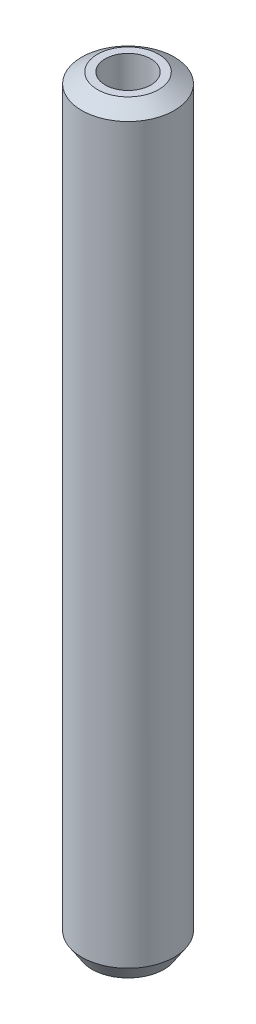
ISO-10303-21;
HEADER;
FILE_DESCRIPTION(('STEP AP214'),'2;1');
FILE_NAME('part.step','',(''),(''),'','','');
FILE_SCHEMA(('AUTOMOTIVE_DESIGN { 1 0 10303 214 1 1 1 1 }'));
ENDSEC;
DATA;
#1=APPLICATION_CONTEXT('core data for automotive mechanical design processes');
#2=APPLICATION_PROTOCOL_DEFINITION('international standard','automotive_design',2000,#1);
#3=PRODUCT_CONTEXT('',#1,'mechanical');
#4=PRODUCT('Part','Part','',(#3));
#5=PRODUCT_RELATED_PRODUCT_CATEGORY('part','',(#4));
#6=PRODUCT_DEFINITION_FORMATION('','',#4);
#7=PRODUCT_DEFINITION_CONTEXT('part definition',#1,'design');
#8=PRODUCT_DEFINITION('design','',#6,#7);
#9=PRODUCT_DEFINITION_SHAPE('','',#8);
#10=(LENGTH_UNIT() NAMED_UNIT(*) SI_UNIT(.MILLI.,.METRE.));
#11=(NAMED_UNIT(*) PLANE_ANGLE_UNIT() SI_UNIT($,.RADIAN.));
#12=(NAMED_UNIT(*) SI_UNIT($,.STERADIAN.) SOLID_ANGLE_UNIT());
#13=UNCERTAINTY_MEASURE_WITH_UNIT(LENGTH_MEASURE(1.E-05),#10,'distance_accuracy_value','');
#14=(GEOMETRIC_REPRESENTATION_CONTEXT(3) GLOBAL_UNCERTAINTY_ASSIGNED_CONTEXT((#13)) GLOBAL_UNIT_ASSIGNED_CONTEXT((#10,
#11,#12)) REPRESENTATION_CONTEXT('',''));
#15=CARTESIAN_POINT('',(0.,0.,0.));
#16=DIRECTION('',(0.,0.,1.));
#17=DIRECTION('',(1.,0.,0.));
#18=AXIS2_PLACEMENT_3D('',#15,#16,#17);
#19=CARTESIAN_POINT('',(0.,327.991136578269,0.));
#20=DIRECTION('',(0.,-1.,0.));
#21=DIRECTION('',(0.,0.,-1.));
#22=AXIS2_PLACEMENT_3D('',#19,#20,#21);
#23=CYLINDRICAL_SURFACE('',#22,20.);
#24=CARTESIAN_POINT('',(0.,323.556740208742,0.));
#25=DIRECTION('',(0.,1.,0.));
#26=DIRECTION('',(0.,0.,1.));
#27=AXIS2_PLACEMENT_3D('',#24,#25,#26);
#28=CIRCLE('',#27,20.);
#29=CARTESIAN_POINT('',(0.,323.556740208742,-20.));
#30=VERTEX_POINT('',#29);
#31=EDGE_CURVE('E50',#30,#30,#28,.F.);
#32=ORIENTED_EDGE('',*,*,#31,.T.);
#33=EDGE_LOOP('',(#32));
#34=FACE_BOUND('',#33,.T.);
#35=CARTESIAN_POINT('',(0.,6.77436812228804,0.));
#36=DIRECTION('',(0.,1.,0.));
#37=DIRECTION('',(0.,0.,1.));
#38=AXIS2_PLACEMENT_3D('',#35,#36,#37);
#39=CIRCLE('',#38,20.);
#40=CARTESIAN_POINT('',(0.,6.77436812228804,20.));
#41=VERTEX_POINT('',#40);
#42=EDGE_CURVE('E51',#41,#41,#39,.T.);
#43=ORIENTED_EDGE('',*,*,#42,.T.);
#44=EDGE_LOOP('',(#43));
#45=FACE_BOUND('',#44,.T.);
#46=ADVANCED_FACE('F39',(#34,#45),#23,.T.);
#47=CARTESIAN_POINT('',(0.,327.991136578269,0.));
#48=DIRECTION('',(0.,1.,0.));
#49=DIRECTION('',(0.,0.,1.));
#50=AXIS2_PLACEMENT_3D('',#47,#48,#49);
#51=PLANE('',#50);
#52=CARTESIAN_POINT('',(0.,327.991136578269,0.));
#53=DIRECTION('',(0.,1.,0.));
#54=DIRECTION('',(0.,0.,1.));
#55=AXIS2_PLACEMENT_3D('',#52,#53,#54);
#56=CIRCLE('',#55,13.2256318777118);
#57=CARTESIAN_POINT('',(0.,327.991136578269,-13.2256318777118));
#58=VERTEX_POINT('',#57);
#59=EDGE_CURVE('E54',#58,#58,#56,.T.);
#60=ORIENTED_EDGE('',*,*,#59,.T.);
#61=EDGE_LOOP('',(#60));
#62=FACE_BOUND('',#61,.T.);
#63=CARTESIAN_POINT('',(0.,327.991136578269,0.));
#64=DIRECTION('',(0.,1.,0.));
#65=DIRECTION('',(0.,0.,1.));
#66=AXIS2_PLACEMENT_3D('',#63,#64,#65);
#67=CIRCLE('',#66,9.83207602068521);
#68=CARTESIAN_POINT('',(0.,327.991136578269,9.83207602068521));
#69=VERTEX_POINT('',#68);
#70=EDGE_CURVE('E58',#69,#69,#67,.T.);
#71=ORIENTED_EDGE('',*,*,#70,.F.);
#72=EDGE_LOOP('',(#71));
#73=FACE_BOUND('',#72,.T.);
#74=ADVANCED_FACE('F69',(#62,#73),#51,.T.);
#75=CARTESIAN_POINT('',(0.,0.,0.));
#76=DIRECTION('',(0.,1.,0.));
#77=DIRECTION('',(0.,0.,1.));
#78=AXIS2_PLACEMENT_3D('',#75,#76,#77);
#79=PLANE('',#78);
#80=CARTESIAN_POINT('',(0.,0.,0.));
#81=DIRECTION('',(0.,1.,0.));
#82=DIRECTION('',(0.,0.,1.));
#83=AXIS2_PLACEMENT_3D('',#80,#81,#82);
#84=CIRCLE('',#83,15.5656036304729);
#85=CARTESIAN_POINT('',(0.,0.,15.5656036304729));
#86=VERTEX_POINT('',#85);
#87=EDGE_CURVE('E10',#86,#86,#84,.F.);
#88=ORIENTED_EDGE('',*,*,#87,.T.);
#89=EDGE_LOOP('',(#88));
#90=FACE_BOUND('',#89,.T.);
#91=CARTESIAN_POINT('',(0.,0.,0.));
#92=DIRECTION('',(0.,1.,0.));
#93=DIRECTION('',(0.,0.,1.));
#94=AXIS2_PLACEMENT_3D('',#91,#92,#93);
#95=CIRCLE('',#94,9.83207602068521);
#96=CARTESIAN_POINT('',(0.,0.,9.83207602068521));
#97=VERTEX_POINT('',#96);
#98=EDGE_CURVE('E63',#97,#97,#95,.T.);
#99=ORIENTED_EDGE('',*,*,#98,.T.);
#100=EDGE_LOOP('',(#99));
#101=FACE_BOUND('',#100,.T.);
#102=ADVANCED_FACE('F75',(#90,#101),#79,.F.);
#103=CARTESIAN_POINT('',(0.,327.991136578269,0.));
#104=DIRECTION('',(0.,-1.,0.));
#105=DIRECTION('',(0.,0.,-1.));
#106=AXIS2_PLACEMENT_3D('',#103,#104,#105);
#107=CYLINDRICAL_SURFACE('',#106,9.83207602068521);
#108=ORIENTED_EDGE('',*,*,#70,.T.);
#109=EDGE_LOOP('',(#108));
#110=FACE_BOUND('',#109,.T.);
#111=ORIENTED_EDGE('',*,*,#98,.F.);
#112=EDGE_LOOP('',(#111));
#113=FACE_BOUND('',#112,.T.);
#114=ADVANCED_FACE('F70',(#110,#113),#107,.F.);
#115=CARTESIAN_POINT('',(0.,327.991136578269,0.));
#116=DIRECTION('',(0.,-1.,0.));
#117=DIRECTION('',(0.,0.,-1.));
#118=AXIS2_PLACEMENT_3D('',#115,#116,#117);
#119=CONICAL_SURFACE('',#118,13.2256318777118,0.991205007525329);
#120=CARTESIAN_POINT('',(0.,323.556740208742,-20.));
#121=CARTESIAN_POINT('',(0.,323.602931837591,-19.9294336653929));
#122=CARTESIAN_POINT('',(0.,323.64912346644,-19.8588673307857));
#123=CARTESIAN_POINT('',(0.,323.741506724139,-19.7177346615714));
#124=CARTESIAN_POINT('',(0.,323.787698352988,-19.6471683269642));
#125=CARTESIAN_POINT('',(0.,323.880081610687,-19.5060356577499));
#126=CARTESIAN_POINT('',(0.,323.926273239536,-19.4354693231427));
#127=CARTESIAN_POINT('',(0.,324.018656497234,-19.2943366539284));
#128=CARTESIAN_POINT('',(0.,324.064848126084,-19.2237703193212));
#129=CARTESIAN_POINT('',(0.,324.157231383782,-19.0826376501069));
#130=CARTESIAN_POINT('',(0.,324.203423012631,-19.0120713154997));
#131=CARTESIAN_POINT('',(0.,324.29580627033,-18.8709386462853));
#132=CARTESIAN_POINT('',(0.,324.341997899179,-18.8003723116782));
#133=CARTESIAN_POINT('',(0.,324.434381156878,-18.6592396424638));
#134=CARTESIAN_POINT('',(0.,324.480572785727,-18.5886733078567));
#135=CARTESIAN_POINT('',(0.,324.572956043425,-18.4475406386423));
#136=CARTESIAN_POINT('',(0.,324.619147672274,-18.3769743040352));
#137=CARTESIAN_POINT('',(0.,324.711530929973,-18.2358416348208));
#138=CARTESIAN_POINT('',(0.,324.757722558822,-18.1652753002137));
#139=CARTESIAN_POINT('',(0.,324.850105816521,-18.0241426309993));
#140=CARTESIAN_POINT('',(0.,324.89629744537,-17.9535762963922));
#141=CARTESIAN_POINT('',(0.,324.988680703068,-17.8124436271778));
#142=CARTESIAN_POINT('',(0.,325.034872331918,-17.7418772925706));
#143=CARTESIAN_POINT('',(0.,325.127255589616,-17.6007446233563));
#144=CARTESIAN_POINT('',(0.,325.173447218465,-17.5301782887491));
#145=CARTESIAN_POINT('',(0.,325.265830476164,-17.3890456195348));
#146=CARTESIAN_POINT('',(0.,325.312022105013,-17.3184792849276));
#147=CARTESIAN_POINT('',(0.,325.404405362712,-17.1773466157133));
#148=CARTESIAN_POINT('',(0.,325.450596991561,-17.1067802811061));
#149=CARTESIAN_POINT('',(0.,325.542980249259,-16.9656476118918));
#150=CARTESIAN_POINT('',(0.,325.589171878109,-16.8950812772846));
#151=CARTESIAN_POINT('',(0.,325.681555135807,-16.7539486080703));
#152=CARTESIAN_POINT('',(0.,325.727746764656,-16.6833822734631));
#153=CARTESIAN_POINT('',(0.,325.820130022355,-16.5422496042488));
#154=CARTESIAN_POINT('',(0.,325.866321651204,-16.4716832696416));
#155=CARTESIAN_POINT('',(0.,325.958704908902,-16.3305506004273));
#156=CARTESIAN_POINT('',(0.,326.004896537752,-16.2599842658201));
#157=CARTESIAN_POINT('',(0.,326.09727979545,-16.1188515966058));
#158=CARTESIAN_POINT('',(0.,326.143471424299,-16.0482852619986));
#159=CARTESIAN_POINT('',(0.,326.235854681998,-15.9071525927843));
#160=CARTESIAN_POINT('',(0.,326.282046310847,-15.8365862581771));
#161=CARTESIAN_POINT('',(0.,326.374429568546,-15.6954535889628));
#162=CARTESIAN_POINT('',(0.,326.420621197395,-15.6248872543556));
#163=CARTESIAN_POINT('',(0.,326.513004455093,-15.4837545851412));
#164=CARTESIAN_POINT('',(0.,326.559196083943,-15.4131882505341));
#165=CARTESIAN_POINT('',(0.,326.651579341641,-15.2720555813197));
#166=CARTESIAN_POINT('',(0.,326.69777097049,-15.2014892467126));
#167=CARTESIAN_POINT('',(0.,326.790154228189,-15.0603565774982));
#168=CARTESIAN_POINT('',(0.,326.836345857038,-14.9897902428911));
#169=CARTESIAN_POINT('',(0.,326.928729114737,-14.8486575736767));
#170=CARTESIAN_POINT('',(0.,326.974920743586,-14.7780912390696));
#171=CARTESIAN_POINT('',(0.,327.067304001284,-14.6369585698552));
#172=CARTESIAN_POINT('',(0.,327.113495630134,-14.5663922352481));
#173=CARTESIAN_POINT('',(0.,327.205878887832,-14.4252595660337));
#174=CARTESIAN_POINT('',(0.,327.252070516681,-14.3546932314266));
#175=CARTESIAN_POINT('',(0.,327.34445377438,-14.2135605622122));
#176=CARTESIAN_POINT('',(0.,327.390645403229,-14.142994227605));
#177=CARTESIAN_POINT('',(0.,327.483028660927,-14.0018615583907));
#178=CARTESIAN_POINT('',(0.,327.529220289777,-13.9312952237835));
#179=CARTESIAN_POINT('',(0.,327.621603547475,-13.7901625545692));
#180=CARTESIAN_POINT('',(0.,327.667795176324,-13.719596219962));
#181=CARTESIAN_POINT('',(0.,327.760178434023,-13.5784635507477));
#182=CARTESIAN_POINT('',(0.,327.806370062872,-13.5078972161405));
#183=CARTESIAN_POINT('',(0.,327.898753320571,-13.3667645469262));
#184=CARTESIAN_POINT('',(0.,327.94494494942,-13.296198212319));
#185=CARTESIAN_POINT('',(0.,327.991136578269,-13.2256318777118));
#186=B_SPLINE_CURVE_WITH_KNOTS('',3,(#120,#121,#122,#123,#124,#125,#126,#127,#128,#129,#130,
#131,#132,#133,#134,#135,#136,#137,#138,#139,#140,#141,#142,#143,#144,#145,#146,#147,#148,#149,
#150,#151,#152,#153,#154,#155,#156,#157,#158,#159,#160,#161,#162,#163,#164,#165,#166,#167,#168,
#169,#170,#171,#172,#173,#174,#175,#176,#177,#178,#179,#180,#181,#182,#183,#184,#185),
.UNSPECIFIED.,.F.,.F.,(4,2,2,2,2,2,2,2,2,2,2,2,2,2,2,2,2,2,2,2,2,2,2,2,2,2,2,2,2,2,2,2,4),(0.,
0.253020685717036,0.506041371434099,0.759062057151162,1.01208274286823,1.26510342858529,
1.51812411430236,1.77114480001942,2.02416548573648,2.27718617145355,2.53020685717061,
2.78322754288768,3.03624822860474,3.2892689143218,3.54228960003887,3.79531028575593,
4.048330971473,4.30135165719003,4.5543723429071,4.80739302862416,5.06041371434122,
5.31343440005829,5.56645508577535,5.81947577149241,6.07249645720948,6.32551714292654,
6.57853782864361,6.83155851436067,7.08457920007773,7.3375998857948,7.59062057151186,
7.84364125722893,8.09666194294599),.UNSPECIFIED.);
#187=EDGE_CURVE('BSEAM81',#30,#58,#186,.T.);
#188=ORIENTED_EDGE('',*,*,#31,.F.);
#189=ORIENTED_EDGE('',*,*,#59,.F.);
#190=ORIENTED_EDGE('',*,*,#187,.T.);
#191=ORIENTED_EDGE('',*,*,#187,.F.);
#192=EDGE_LOOP('',(#188,#190,#189,#191));
#193=FACE_BOUND('',#192,.T.);
#194=ADVANCED_FACE('F81',(#193),#119,.T.);
#195=CARTESIAN_POINT('',(0.,6.77436812228804,0.));
#196=DIRECTION('',(0.,1.,0.));
#197=DIRECTION('',(0.,0.,1.));
#198=AXIS2_PLACEMENT_3D('',#195,#196,#197);
#199=CONICAL_SURFACE('',#198,20.,0.579591319269579);
#200=ORIENTED_EDGE('',*,*,#87,.F.);
#201=EDGE_LOOP('',(#200));
#202=FACE_BOUND('',#201,.T.);
#203=ORIENTED_EDGE('',*,*,#42,.F.);
#204=EDGE_LOOP('',(#203));
#205=FACE_BOUND('',#204,.T.);
#206=ADVANCED_FACE('F45',(#202,#205),#199,.T.);
#207=CLOSED_SHELL('',(#46,#74,#102,#114,#194,#206));
#208=MANIFOLD_SOLID_BREP('B2',#207);
#209=ADVANCED_BREP_SHAPE_REPRESENTATION('',(#18,#208),#14);
#210=SHAPE_DEFINITION_REPRESENTATION(#9,#209);
ENDSEC;
END-ISO-10303-21;
